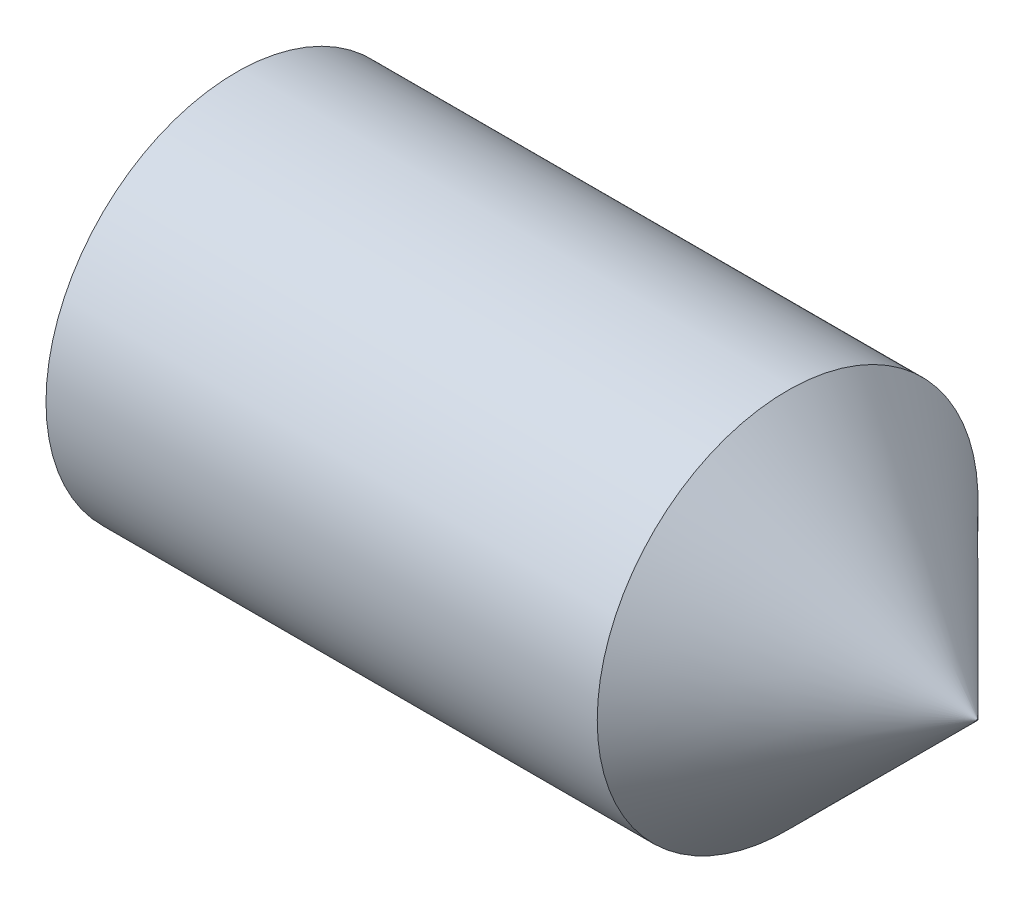
ISO-10303-21;
HEADER;
FILE_DESCRIPTION(('STEP AP214'),'2;1');
FILE_NAME('part.step','',(''),(''),'','','');
FILE_SCHEMA(('AUTOMOTIVE_DESIGN { 1 0 10303 214 1 1 1 1 }'));
ENDSEC;
DATA;
#1=APPLICATION_CONTEXT('core data for automotive mechanical design processes');
#2=APPLICATION_PROTOCOL_DEFINITION('international standard','automotive_design',2000,#1);
#3=PRODUCT_CONTEXT('',#1,'mechanical');
#4=PRODUCT('Part','Part','',(#3));
#5=PRODUCT_RELATED_PRODUCT_CATEGORY('part','',(#4));
#6=PRODUCT_DEFINITION_FORMATION('','',#4);
#7=PRODUCT_DEFINITION_CONTEXT('part definition',#1,'design');
#8=PRODUCT_DEFINITION('design','',#6,#7);
#9=PRODUCT_DEFINITION_SHAPE('','',#8);
#10=(LENGTH_UNIT() NAMED_UNIT(*) SI_UNIT(.MILLI.,.METRE.));
#11=(NAMED_UNIT(*) PLANE_ANGLE_UNIT() SI_UNIT($,.RADIAN.));
#12=(NAMED_UNIT(*) SI_UNIT($,.STERADIAN.) SOLID_ANGLE_UNIT());
#13=UNCERTAINTY_MEASURE_WITH_UNIT(LENGTH_MEASURE(1.E-05),#10,'distance_accuracy_value','');
#14=(GEOMETRIC_REPRESENTATION_CONTEXT(3) GLOBAL_UNCERTAINTY_ASSIGNED_CONTEXT((#13)) GLOBAL_UNIT_ASSIGNED_CONTEXT((#10,
#11,#12)) REPRESENTATION_CONTEXT('',''));
#15=CARTESIAN_POINT('',(0.,0.,0.));
#16=DIRECTION('',(0.,0.,1.));
#17=DIRECTION('',(1.,0.,0.));
#18=AXIS2_PLACEMENT_3D('',#15,#16,#17);
#19=CARTESIAN_POINT('',(0.,0.,0.));
#20=DIRECTION('',(-1.,0.,0.));
#21=DIRECTION('',(0.,0.,1.));
#22=AXIS2_PLACEMENT_3D('',#19,#20,#21);
#23=PLANE('',#22);
#24=CARTESIAN_POINT('',(0.,0.,0.));
#25=DIRECTION('',(-1.,0.,0.));
#26=DIRECTION('',(0.,0.,1.));
#27=AXIS2_PLACEMENT_3D('',#24,#25,#26);
#28=CIRCLE('',#27,1.2195);
#29=CARTESIAN_POINT('',(0.,0.,1.2195));
#30=VERTEX_POINT('',#29);
#31=EDGE_CURVE('E11',#30,#30,#28,.T.);
#32=ORIENTED_EDGE('',*,*,#31,.T.);
#33=EDGE_LOOP('',(#32));
#34=FACE_BOUND('',#33,.T.);
#35=DIRECTION('',(0.,0.,-1.));
#36=VECTOR('',#35,1.);
#37=CARTESIAN_POINT('',(0.,0.750000000000003,0.433012701892217));
#38=LINE('',#37,#36);
#39=CARTESIAN_POINT('',(0.,0.750000000000003,0.433012701892217));
#40=VERTEX_POINT('',#39);
#41=CARTESIAN_POINT('',(0.,0.750000000000003,-0.433012701892222));
#42=VERTEX_POINT('',#41);
#43=EDGE_CURVE('E128',#40,#42,#38,.T.);
#44=ORIENTED_EDGE('',*,*,#43,.F.);
#45=DIRECTION('',(0.,-0.866025403784439,0.5));
#46=VECTOR('',#45,1.);
#47=CARTESIAN_POINT('',(0.,0.750000000000003,0.433012701892217));
#48=LINE('',#47,#46);
#49=CARTESIAN_POINT('',(0.,0.,0.866025403784436));
#50=VERTEX_POINT('',#49);
#51=EDGE_CURVE('E50',#40,#50,#48,.T.);
#52=ORIENTED_EDGE('',*,*,#51,.T.);
#53=DIRECTION('',(0.,0.866025403784439,0.5));
#54=VECTOR('',#53,1.);
#55=CARTESIAN_POINT('',(0.,-0.749999999999997,0.433012701892217));
#56=LINE('',#55,#54);
#57=CARTESIAN_POINT('',(0.,-0.749999999999997,0.433012701892217));
#58=VERTEX_POINT('',#57);
#59=EDGE_CURVE('E119',#58,#50,#56,.T.);
#60=ORIENTED_EDGE('',*,*,#59,.F.);
#61=DIRECTION('',(0.,0.,-1.));
#62=VECTOR('',#61,1.);
#63=CARTESIAN_POINT('',(0.,-0.749999999999997,0.433012701892217));
#64=LINE('',#63,#62);
#65=CARTESIAN_POINT('',(0.,-0.749999999999997,-0.433012701892222));
#66=VERTEX_POINT('',#65);
#67=EDGE_CURVE('E122',#58,#66,#64,.T.);
#68=ORIENTED_EDGE('',*,*,#67,.T.);
#69=DIRECTION('',(0.,0.866025403784438,-0.5));
#70=VECTOR('',#69,1.);
#71=CARTESIAN_POINT('',(0.,-0.749999999999997,-0.433012701892222));
#72=LINE('',#71,#70);
#73=CARTESIAN_POINT('',(0.,0.,-0.866025403784442));
#74=VERTEX_POINT('',#73);
#75=EDGE_CURVE('E125',#66,#74,#72,.T.);
#76=ORIENTED_EDGE('',*,*,#75,.T.);
#77=DIRECTION('',(0.,-0.866025403784439,-0.5));
#78=VECTOR('',#77,1.);
#79=CARTESIAN_POINT('',(0.,0.750000000000003,-0.433012701892222));
#80=LINE('',#79,#78);
#81=EDGE_CURVE('E108',#42,#74,#80,.T.);
#82=ORIENTED_EDGE('',*,*,#81,.F.);
#83=EDGE_LOOP('',(#44,#52,#60,#68,#76,#82));
#84=FACE_BOUND('',#83,.T.);
#85=ADVANCED_FACE('F36',(#34,#84),#23,.T.);
#86=CARTESIAN_POINT('',(0.,0.,0.));
#87=DIRECTION('',(1.,0.,0.));
#88=DIRECTION('',(0.,0.,-1.));
#89=AXIS2_PLACEMENT_3D('',#86,#87,#88);
#90=CONICAL_SURFACE('',#89,1.2195,1.0471975511966);
#91=CARTESIAN_POINT('',(0.161946750507689,0.,0.));
#92=DIRECTION('',(-1.,0.,0.));
#93=DIRECTION('',(0.,0.,1.));
#94=AXIS2_PLACEMENT_3D('',#91,#92,#93);
#95=CIRCLE('',#94,1.5);
#96=CARTESIAN_POINT('',(0.161946750507689,0.,1.5));
#97=VERTEX_POINT('',#96);
#98=EDGE_CURVE('E43',#97,#97,#95,.T.);
#99=ORIENTED_EDGE('',*,*,#98,.T.);
#100=EDGE_LOOP('',(#99));
#101=FACE_BOUND('',#100,.T.);
#102=ORIENTED_EDGE('',*,*,#31,.F.);
#103=EDGE_LOOP('',(#102));
#104=FACE_BOUND('',#103,.T.);
#105=ADVANCED_FACE('F145',(#101,#104),#90,.T.);
#106=CARTESIAN_POINT('',(-12.7,0.,0.));
#107=DIRECTION('',(-1.,0.,0.));
#108=DIRECTION('',(0.,0.,1.));
#109=AXIS2_PLACEMENT_3D('',#106,#107,#108);
#110=CYLINDRICAL_SURFACE('',#109,1.5);
#111=CARTESIAN_POINT('',(4.50500000000001,0.,0.));
#112=DIRECTION('',(-1.,0.,0.));
#113=DIRECTION('',(0.,0.,1.));
#114=AXIS2_PLACEMENT_3D('',#111,#112,#113);
#115=CIRCLE('',#114,1.5);
#116=CARTESIAN_POINT('',(4.50500000000001,0.,1.5));
#117=VERTEX_POINT('',#116);
#118=EDGE_CURVE('E140',#117,#117,#115,.T.);
#119=ORIENTED_EDGE('',*,*,#118,.T.);
#120=EDGE_LOOP('',(#119));
#121=FACE_BOUND('',#120,.T.);
#122=ORIENTED_EDGE('',*,*,#98,.F.);
#123=EDGE_LOOP('',(#122));
#124=FACE_BOUND('',#123,.T.);
#125=ADVANCED_FACE('F148',(#121,#124),#110,.T.);
#126=CARTESIAN_POINT('',(6.,0.,0.));
#127=DIRECTION('',(-1.,0.,0.));
#128=DIRECTION('',(0.,0.,1.));
#129=AXIS2_PLACEMENT_3D('',#126,#127,#128);
#130=CONICAL_SURFACE('',#129,0.0049999999999998,0.785398163397451);
#131=ORIENTED_EDGE('',*,*,#118,.F.);
#132=EDGE_LOOP('',(#131));
#133=FACE_BOUND('',#132,.T.);
#134=CARTESIAN_POINT('',(6.,0.,0.));
#135=DIRECTION('',(-1.,0.,0.));
#136=DIRECTION('',(0.,0.,1.));
#137=AXIS2_PLACEMENT_3D('',#134,#135,#136);
#138=CIRCLE('',#137,0.0049999999999998);
#139=CARTESIAN_POINT('',(6.,0.,0.0049999999999998));
#140=VERTEX_POINT('',#139);
#141=EDGE_CURVE('E137',#140,#140,#138,.T.);
#142=ORIENTED_EDGE('',*,*,#141,.T.);
#143=EDGE_LOOP('',(#142));
#144=FACE_BOUND('',#143,.T.);
#145=ADVANCED_FACE('F150',(#133,#144),#130,.T.);
#146=CARTESIAN_POINT('',(6.,0.,0.));
#147=DIRECTION('',(-1.,0.,0.));
#148=DIRECTION('',(0.,0.,1.));
#149=AXIS2_PLACEMENT_3D('',#146,#147,#148);
#150=PLANE('',#149);
#151=ORIENTED_EDGE('',*,*,#141,.F.);
#152=EDGE_LOOP('',(#151));
#153=FACE_BOUND('',#152,.T.);
#154=ADVANCED_FACE('F157',(#153),#150,.F.);
#155=CARTESIAN_POINT('',(2.1,0.750000000000003,0.433012701892217));
#156=DIRECTION('',(0.,-0.5,-0.866025403784439));
#157=DIRECTION('',(0.,0.866025403784439,-0.5));
#158=AXIS2_PLACEMENT_3D('',#155,#156,#157);
#159=PLANE('',#158);
#160=ORIENTED_EDGE('',*,*,#51,.F.);
#161=DIRECTION('',(-1.,0.,0.));
#162=VECTOR('',#161,1.);
#163=CARTESIAN_POINT('',(2.1,0.750000000000003,0.433012701892217));
#164=LINE('',#163,#162);
#165=CARTESIAN_POINT('',(2.1,0.750000000000003,0.433012701892217));
#166=VERTEX_POINT('',#165);
#167=EDGE_CURVE('E55',#166,#40,#164,.T.);
#168=ORIENTED_EDGE('',*,*,#167,.F.);
#169=DIRECTION('',(0.,-0.866025403784439,0.5));
#170=VECTOR('',#169,1.);
#171=CARTESIAN_POINT('',(2.1,0.750000000000003,0.433012701892217));
#172=LINE('',#171,#170);
#173=CARTESIAN_POINT('',(2.1,0.,0.866025403784436));
#174=VERTEX_POINT('',#173);
#175=EDGE_CURVE('E82',#166,#174,#172,.T.);
#176=ORIENTED_EDGE('',*,*,#175,.T.);
#177=DIRECTION('',(-1.,0.,0.));
#178=VECTOR('',#177,1.);
#179=CARTESIAN_POINT('',(2.1,0.,0.866025403784436));
#180=LINE('',#179,#178);
#181=EDGE_CURVE('E135',#174,#50,#180,.T.);
#182=ORIENTED_EDGE('',*,*,#181,.T.);
#183=EDGE_LOOP('',(#160,#168,#176,#182));
#184=FACE_BOUND('',#183,.T.);
#185=ADVANCED_FACE('F188',(#184),#159,.T.);
#186=CARTESIAN_POINT('',(2.1,-0.749999999999997,0.433012701892217));
#187=DIRECTION('',(0.,-0.5,0.866025403784439));
#188=DIRECTION('',(0.,-0.866025403784439,-0.5));
#189=AXIS2_PLACEMENT_3D('',#186,#187,#188);
#190=PLANE('',#189);
#191=ORIENTED_EDGE('',*,*,#59,.T.);
#192=ORIENTED_EDGE('',*,*,#181,.F.);
#193=DIRECTION('',(0.,0.866025403784439,0.5));
#194=VECTOR('',#193,1.);
#195=CARTESIAN_POINT('',(2.1,-0.749999999999997,0.433012701892217));
#196=LINE('',#195,#194);
#197=CARTESIAN_POINT('',(2.1,-0.749999999999997,0.433012701892217));
#198=VERTEX_POINT('',#197);
#199=EDGE_CURVE('E267',#198,#174,#196,.T.);
#200=ORIENTED_EDGE('',*,*,#199,.F.);
#201=DIRECTION('',(-1.,0.,0.));
#202=VECTOR('',#201,1.);
#203=CARTESIAN_POINT('',(2.1,-0.749999999999997,0.433012701892217));
#204=LINE('',#203,#202);
#205=EDGE_CURVE('E133',#198,#58,#204,.T.);
#206=ORIENTED_EDGE('',*,*,#205,.T.);
#207=EDGE_LOOP('',(#191,#192,#200,#206));
#208=FACE_BOUND('',#207,.T.);
#209=ADVANCED_FACE('F184',(#208),#190,.F.);
#210=CARTESIAN_POINT('',(2.1,-0.749999999999997,0.433012701892217));
#211=DIRECTION('',(0.,1.,0.));
#212=DIRECTION('',(0.,0.,1.));
#213=AXIS2_PLACEMENT_3D('',#210,#211,#212);
#214=PLANE('',#213);
#215=ORIENTED_EDGE('',*,*,#67,.F.);
#216=ORIENTED_EDGE('',*,*,#205,.F.);
#217=DIRECTION('',(0.,0.,-1.));
#218=VECTOR('',#217,1.);
#219=CARTESIAN_POINT('',(2.1,-0.749999999999997,0.433012701892217));
#220=LINE('',#219,#218);
#221=CARTESIAN_POINT('',(2.1,-0.749999999999997,-0.433012701892222));
#222=VERTEX_POINT('',#221);
#223=EDGE_CURVE('E103',#198,#222,#220,.T.);
#224=ORIENTED_EDGE('',*,*,#223,.T.);
#225=DIRECTION('',(-1.,0.,0.));
#226=VECTOR('',#225,1.);
#227=CARTESIAN_POINT('',(2.1,-0.749999999999997,-0.433012701892222));
#228=LINE('',#227,#226);
#229=EDGE_CURVE('E98',#222,#66,#228,.T.);
#230=ORIENTED_EDGE('',*,*,#229,.T.);
#231=EDGE_LOOP('',(#215,#216,#224,#230));
#232=FACE_BOUND('',#231,.T.);
#233=ADVANCED_FACE('F181',(#232),#214,.T.);
#234=CARTESIAN_POINT('',(2.1,-0.749999999999997,-0.433012701892222));
#235=DIRECTION('',(0.,0.5,0.866025403784438));
#236=DIRECTION('',(0.,-0.866025403784439,0.5));
#237=AXIS2_PLACEMENT_3D('',#234,#235,#236);
#238=PLANE('',#237);
#239=ORIENTED_EDGE('',*,*,#75,.F.);
#240=ORIENTED_EDGE('',*,*,#229,.F.);
#241=DIRECTION('',(0.,0.866025403784438,-0.5));
#242=VECTOR('',#241,1.);
#243=CARTESIAN_POINT('',(2.1,-0.749999999999997,-0.433012701892222));
#244=LINE('',#243,#242);
#245=CARTESIAN_POINT('',(2.1,0.,-0.866025403784442));
#246=VERTEX_POINT('',#245);
#247=EDGE_CURVE('E93',#222,#246,#244,.T.);
#248=ORIENTED_EDGE('',*,*,#247,.T.);
#249=DIRECTION('',(-1.,0.,0.));
#250=VECTOR('',#249,1.);
#251=CARTESIAN_POINT('',(2.1,0.,-0.866025403784442));
#252=LINE('',#251,#250);
#253=EDGE_CURVE('E97',#246,#74,#252,.T.);
#254=ORIENTED_EDGE('',*,*,#253,.T.);
#255=EDGE_LOOP('',(#239,#240,#248,#254));
#256=FACE_BOUND('',#255,.T.);
#257=ADVANCED_FACE('F96',(#256),#238,.T.);
#258=CARTESIAN_POINT('',(2.1,0.750000000000003,-0.433012701892222));
#259=DIRECTION('',(0.,0.5,-0.866025403784439));
#260=DIRECTION('',(0.,0.866025403784439,0.5));
#261=AXIS2_PLACEMENT_3D('',#258,#259,#260);
#262=PLANE('',#261);
#263=ORIENTED_EDGE('',*,*,#81,.T.);
#264=ORIENTED_EDGE('',*,*,#253,.F.);
#265=DIRECTION('',(0.,-0.866025403784439,-0.5));
#266=VECTOR('',#265,1.);
#267=CARTESIAN_POINT('',(2.1,0.750000000000003,-0.433012701892222));
#268=LINE('',#267,#266);
#269=CARTESIAN_POINT('',(2.1,0.750000000000003,-0.433012701892222));
#270=VERTEX_POINT('',#269);
#271=EDGE_CURVE('E102',#270,#246,#268,.T.);
#272=ORIENTED_EDGE('',*,*,#271,.F.);
#273=DIRECTION('',(-1.,0.,0.));
#274=VECTOR('',#273,1.);
#275=CARTESIAN_POINT('',(2.1,0.750000000000003,-0.433012701892222));
#276=LINE('',#275,#274);
#277=EDGE_CURVE('E78',#270,#42,#276,.T.);
#278=ORIENTED_EDGE('',*,*,#277,.T.);
#279=EDGE_LOOP('',(#263,#264,#272,#278));
#280=FACE_BOUND('',#279,.T.);
#281=ADVANCED_FACE('F105',(#280),#262,.F.);
#282=CARTESIAN_POINT('',(2.1,0.750000000000003,0.433012701892217));
#283=DIRECTION('',(0.,1.,0.));
#284=DIRECTION('',(0.,0.,1.));
#285=AXIS2_PLACEMENT_3D('',#282,#283,#284);
#286=PLANE('',#285);
#287=ORIENTED_EDGE('',*,*,#43,.T.);
#288=ORIENTED_EDGE('',*,*,#277,.F.);
#289=DIRECTION('',(0.,0.,-1.));
#290=VECTOR('',#289,1.);
#291=CARTESIAN_POINT('',(2.1,0.750000000000003,0.433012701892217));
#292=LINE('',#291,#290);
#293=EDGE_CURVE('E113',#166,#270,#292,.T.);
#294=ORIENTED_EDGE('',*,*,#293,.F.);
#295=ORIENTED_EDGE('',*,*,#167,.T.);
#296=EDGE_LOOP('',(#287,#288,#294,#295));
#297=FACE_BOUND('',#296,.T.);
#298=ADVANCED_FACE('F169',(#297),#286,.F.);
#299=CARTESIAN_POINT('',(2.1,-0.749999999999997,1.29903810567666));
#300=DIRECTION('',(1.,0.,0.));
#301=DIRECTION('',(0.,0.,-1.));
#302=AXIS2_PLACEMENT_3D('',#299,#300,#301);
#303=PLANE('',#302);
#304=ORIENTED_EDGE('',*,*,#175,.F.);
#305=ORIENTED_EDGE('',*,*,#293,.T.);
#306=ORIENTED_EDGE('',*,*,#271,.T.);
#307=ORIENTED_EDGE('',*,*,#247,.F.);
#308=ORIENTED_EDGE('',*,*,#223,.F.);
#309=ORIENTED_EDGE('',*,*,#199,.T.);
#310=EDGE_LOOP('',(#304,#305,#306,#307,#308,#309));
#311=FACE_BOUND('',#310,.T.);
#312=ADVANCED_FACE('F111',(#311),#303,.F.);
#313=CLOSED_SHELL('',(#85,#105,#125,#145,#154,#185,#209,#233,#257,#281,#298,#312));
#314=MANIFOLD_SOLID_BREP('B2',#313);
#315=ADVANCED_BREP_SHAPE_REPRESENTATION('',(#18,#314),#14);
#316=SHAPE_DEFINITION_REPRESENTATION(#9,#315);
ENDSEC;
END-ISO-10303-21;
